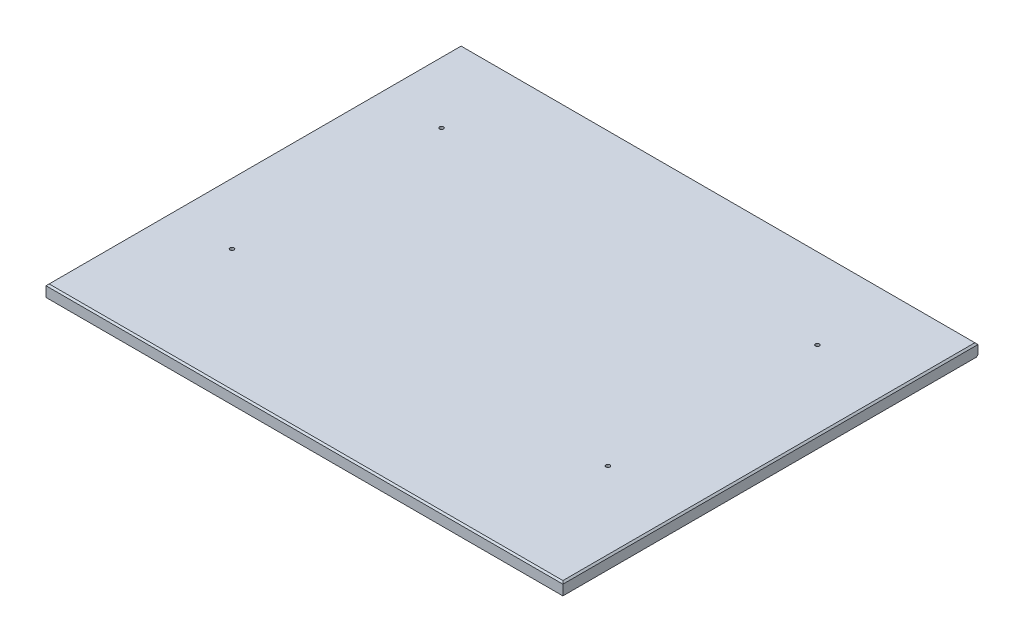
ISO-10303-21;
HEADER;
FILE_DESCRIPTION(('STEP AP214'),'2;1');
FILE_NAME('part.step','',(''),(''),'','','');
FILE_SCHEMA(('AUTOMOTIVE_DESIGN { 1 0 10303 214 1 1 1 1 }'));
ENDSEC;
DATA;
#1=APPLICATION_CONTEXT('core data for automotive mechanical design processes');
#2=APPLICATION_PROTOCOL_DEFINITION('international standard','automotive_design',2000,#1);
#3=PRODUCT_CONTEXT('',#1,'mechanical');
#4=PRODUCT('Part','Part','',(#3));
#5=PRODUCT_RELATED_PRODUCT_CATEGORY('part','',(#4));
#6=PRODUCT_DEFINITION_FORMATION('','',#4);
#7=PRODUCT_DEFINITION_CONTEXT('part definition',#1,'design');
#8=PRODUCT_DEFINITION('design','',#6,#7);
#9=PRODUCT_DEFINITION_SHAPE('','',#8);
#10=(LENGTH_UNIT() NAMED_UNIT(*) SI_UNIT(.MILLI.,.METRE.));
#11=(NAMED_UNIT(*) PLANE_ANGLE_UNIT() SI_UNIT($,.RADIAN.));
#12=(NAMED_UNIT(*) SI_UNIT($,.STERADIAN.) SOLID_ANGLE_UNIT());
#13=UNCERTAINTY_MEASURE_WITH_UNIT(LENGTH_MEASURE(1.E-05),#10,'distance_accuracy_value','');
#14=(GEOMETRIC_REPRESENTATION_CONTEXT(3) GLOBAL_UNCERTAINTY_ASSIGNED_CONTEXT((#13)) GLOBAL_UNIT_ASSIGNED_CONTEXT((#10,
#11,#12)) REPRESENTATION_CONTEXT('',''));
#15=CARTESIAN_POINT('',(0.,0.,0.));
#16=DIRECTION('',(0.,0.,1.));
#17=DIRECTION('',(1.,0.,0.));
#18=AXIS2_PLACEMENT_3D('',#15,#16,#17);
#19=CARTESIAN_POINT('',(0.,19.05,0.));
#20=DIRECTION('',(1.,0.,0.));
#21=DIRECTION('',(0.,0.,-1.));
#22=AXIS2_PLACEMENT_3D('',#19,#20,#21);
#23=PLANE('',#22);
#24=DIRECTION('',(0.,-1.,0.));
#25=VECTOR('',#24,1.);
#26=CARTESIAN_POINT('',(0.,19.05,-673.1));
#27=LINE('',#26,#25);
#28=CARTESIAN_POINT('',(0.,16.51,-673.1));
#29=VERTEX_POINT('',#28);
#30=CARTESIAN_POINT('',(0.,2.53999999999999,-673.1));
#31=VERTEX_POINT('',#30);
#32=EDGE_CURVE('E118',#29,#31,#27,.T.);
#33=ORIENTED_EDGE('',*,*,#32,.T.);
#34=DIRECTION('',(0.,-0.707106781186548,0.707106781186548));
#35=VECTOR('',#34,1.);
#36=CARTESIAN_POINT('',(0.,2.53999999999999,-673.1));
#37=LINE('',#36,#35);
#38=CARTESIAN_POINT('',(0.,0.,-670.56));
#39=VERTEX_POINT('',#38);
#40=EDGE_CURVE('E64',#31,#39,#37,.T.);
#41=ORIENTED_EDGE('',*,*,#40,.T.);
#42=DIRECTION('',(0.,0.,1.));
#43=VECTOR('',#42,1.);
#44=CARTESIAN_POINT('',(0.,0.,0.));
#45=LINE('',#44,#43);
#46=CARTESIAN_POINT('',(0.,0.,0.));
#47=VERTEX_POINT('',#46);
#48=EDGE_CURVE('E98',#39,#47,#45,.T.);
#49=ORIENTED_EDGE('',*,*,#48,.T.);
#50=DIRECTION('',(0.,-1.,0.));
#51=VECTOR('',#50,1.);
#52=CARTESIAN_POINT('',(0.,19.05,0.));
#53=LINE('',#52,#51);
#54=CARTESIAN_POINT('',(0.,16.51,0.));
#55=VERTEX_POINT('',#54);
#56=EDGE_CURVE('E100',#55,#47,#53,.T.);
#57=ORIENTED_EDGE('',*,*,#56,.F.);
#58=DIRECTION('',(0.,0.,-1.));
#59=VECTOR('',#58,1.);
#60=CARTESIAN_POINT('',(0.,16.51,0.));
#61=LINE('',#60,#59);
#62=EDGE_CURVE('E141',#55,#29,#61,.T.);
#63=ORIENTED_EDGE('',*,*,#62,.T.);
#64=EDGE_LOOP('',(#33,#41,#49,#57,#63));
#65=FACE_BOUND('',#64,.T.);
#66=ADVANCED_FACE('F41',(#65),#23,.F.);
#67=CARTESIAN_POINT('',(0.,19.05,0.));
#68=DIRECTION('',(0.,0.,-1.));
#69=DIRECTION('',(-1.,0.,0.));
#70=AXIS2_PLACEMENT_3D('',#67,#68,#69);
#71=PLANE('',#70);
#72=DIRECTION('',(0.,-1.,0.));
#73=VECTOR('',#72,1.);
#74=CARTESIAN_POINT('',(838.2,19.05,0.));
#75=LINE('',#74,#73);
#76=CARTESIAN_POINT('',(838.2,16.51,0.));
#77=VERTEX_POINT('',#76);
#78=CARTESIAN_POINT('',(838.2,0.,0.));
#79=VERTEX_POINT('',#78);
#80=EDGE_CURVE('E113',#77,#79,#75,.T.);
#81=ORIENTED_EDGE('',*,*,#80,.F.);
#82=DIRECTION('',(-1.,0.,0.));
#83=VECTOR('',#82,1.);
#84=CARTESIAN_POINT('',(0.,16.51,0.));
#85=LINE('',#84,#83);
#86=EDGE_CURVE('E111',#77,#55,#85,.T.);
#87=ORIENTED_EDGE('',*,*,#86,.T.);
#88=ORIENTED_EDGE('',*,*,#56,.T.);
#89=DIRECTION('',(1.,0.,0.));
#90=VECTOR('',#89,1.);
#91=CARTESIAN_POINT('',(0.,0.,0.));
#92=LINE('',#91,#90);
#93=EDGE_CURVE('E103',#47,#79,#92,.T.);
#94=ORIENTED_EDGE('',*,*,#93,.T.);
#95=EDGE_LOOP('',(#81,#87,#88,#94));
#96=FACE_BOUND('',#95,.T.);
#97=ADVANCED_FACE('F109',(#96),#71,.F.);
#98=CARTESIAN_POINT('',(838.2,19.05,0.));
#99=DIRECTION('',(-1.,0.,0.));
#100=DIRECTION('',(0.,0.,1.));
#101=AXIS2_PLACEMENT_3D('',#98,#99,#100);
#102=PLANE('',#101);
#103=DIRECTION('',(0.,0.,-1.));
#104=VECTOR('',#103,1.);
#105=CARTESIAN_POINT('',(838.2,0.,0.));
#106=LINE('',#105,#104);
#107=CARTESIAN_POINT('',(838.2,0.,-670.56));
#108=VERTEX_POINT('',#107);
#109=EDGE_CURVE('E116',#79,#108,#106,.T.);
#110=ORIENTED_EDGE('',*,*,#109,.T.);
#111=DIRECTION('',(0.,0.707106781186548,-0.707106781186548));
#112=VECTOR('',#111,1.);
#113=CARTESIAN_POINT('',(838.2,2.53999999999999,-673.1));
#114=LINE('',#113,#112);
#115=CARTESIAN_POINT('',(838.2,2.53999999999999,-673.1));
#116=VERTEX_POINT('',#115);
#117=EDGE_CURVE('E11',#108,#116,#114,.T.);
#118=ORIENTED_EDGE('',*,*,#117,.T.);
#119=DIRECTION('',(0.,-1.,0.));
#120=VECTOR('',#119,1.);
#121=CARTESIAN_POINT('',(838.2,19.05,-673.1));
#122=LINE('',#121,#120);
#123=CARTESIAN_POINT('',(838.2,16.51,-673.1));
#124=VERTEX_POINT('',#123);
#125=EDGE_CURVE('E123',#124,#116,#122,.T.);
#126=ORIENTED_EDGE('',*,*,#125,.F.);
#127=DIRECTION('',(0.,0.,1.));
#128=VECTOR('',#127,1.);
#129=CARTESIAN_POINT('',(838.2,16.51,0.));
#130=LINE('',#129,#128);
#131=EDGE_CURVE('E138',#124,#77,#130,.T.);
#132=ORIENTED_EDGE('',*,*,#131,.T.);
#133=ORIENTED_EDGE('',*,*,#80,.T.);
#134=EDGE_LOOP('',(#110,#118,#126,#132,#133));
#135=FACE_BOUND('',#134,.T.);
#136=ADVANCED_FACE('F175',(#135),#102,.F.);
#137=CARTESIAN_POINT('',(0.,19.05,-673.1));
#138=DIRECTION('',(0.,0.,1.));
#139=DIRECTION('',(1.,0.,0.));
#140=AXIS2_PLACEMENT_3D('',#137,#138,#139);
#141=PLANE('',#140);
#142=ORIENTED_EDGE('',*,*,#125,.T.);
#143=DIRECTION('',(-1.,0.,0.));
#144=VECTOR('',#143,1.);
#145=CARTESIAN_POINT('',(0.,2.53999999999999,-673.1));
#146=LINE('',#145,#144);
#147=EDGE_CURVE('E143',#116,#31,#146,.T.);
#148=ORIENTED_EDGE('',*,*,#147,.T.);
#149=ORIENTED_EDGE('',*,*,#32,.F.);
#150=DIRECTION('',(1.,0.,0.));
#151=VECTOR('',#150,1.);
#152=CARTESIAN_POINT('',(0.,16.51,-673.1));
#153=LINE('',#152,#151);
#154=EDGE_CURVE('E135',#29,#124,#153,.T.);
#155=ORIENTED_EDGE('',*,*,#154,.T.);
#156=EDGE_LOOP('',(#142,#148,#149,#155));
#157=FACE_BOUND('',#156,.T.);
#158=ADVANCED_FACE('F159',(#157),#141,.F.);
#159=CARTESIAN_POINT('',(0.,19.05,0.));
#160=DIRECTION('',(0.,-1.,0.));
#161=DIRECTION('',(0.,0.,-1.));
#162=AXIS2_PLACEMENT_3D('',#159,#160,#161);
#163=PLANE('',#162);
#164=CARTESIAN_POINT('',(101.6,19.05,-200.025));
#165=DIRECTION('',(0.,1.,0.));
#166=DIRECTION('',(0.,0.,1.));
#167=AXIS2_PLACEMENT_3D('',#164,#165,#166);
#168=CIRCLE('',#167,3.175);
#169=CARTESIAN_POINT('',(101.6,19.05,-196.85));
#170=VERTEX_POINT('',#169);
#171=EDGE_CURVE('E322',#170,#170,#168,.T.);
#172=ORIENTED_EDGE('',*,*,#171,.F.);
#173=EDGE_LOOP('',(#172));
#174=FACE_BOUND('',#173,.T.);
#175=CARTESIAN_POINT('',(711.2,19.05,-539.75));
#176=DIRECTION('',(0.,1.,0.));
#177=DIRECTION('',(0.,0.,1.));
#178=AXIS2_PLACEMENT_3D('',#175,#176,#177);
#179=CIRCLE('',#178,3.17500000000008);
#180=CARTESIAN_POINT('',(711.2,19.05,-536.575));
#181=VERTEX_POINT('',#180);
#182=EDGE_CURVE('E326',#181,#181,#179,.T.);
#183=ORIENTED_EDGE('',*,*,#182,.F.);
#184=EDGE_LOOP('',(#183));
#185=FACE_BOUND('',#184,.T.);
#186=CARTESIAN_POINT('',(711.2,19.05,-200.025));
#187=DIRECTION('',(0.,1.,0.));
#188=DIRECTION('',(0.,0.,1.));
#189=AXIS2_PLACEMENT_3D('',#186,#187,#188);
#190=CIRCLE('',#189,3.17500000000009);
#191=CARTESIAN_POINT('',(711.2,19.05,-196.85));
#192=VERTEX_POINT('',#191);
#193=EDGE_CURVE('E337',#192,#192,#190,.T.);
#194=ORIENTED_EDGE('',*,*,#193,.F.);
#195=EDGE_LOOP('',(#194));
#196=FACE_BOUND('',#195,.T.);
#197=CARTESIAN_POINT('',(101.6,19.05,-539.75));
#198=DIRECTION('',(0.,1.,0.));
#199=DIRECTION('',(0.,0.,1.));
#200=AXIS2_PLACEMENT_3D('',#197,#198,#199);
#201=CIRCLE('',#200,3.175);
#202=CARTESIAN_POINT('',(101.6,19.05,-536.575));
#203=VERTEX_POINT('',#202);
#204=EDGE_CURVE('E323',#203,#203,#201,.T.);
#205=ORIENTED_EDGE('',*,*,#204,.F.);
#206=EDGE_LOOP('',(#205));
#207=FACE_BOUND('',#206,.T.);
#208=DIRECTION('',(0.,0.,-1.));
#209=VECTOR('',#208,1.);
#210=CARTESIAN_POINT('',(835.66,19.05,0.));
#211=LINE('',#210,#209);
#212=CARTESIAN_POINT('',(835.66,19.05,-2.53999999999999));
#213=VERTEX_POINT('',#212);
#214=CARTESIAN_POINT('',(835.66,19.05,-670.56));
#215=VERTEX_POINT('',#214);
#216=EDGE_CURVE('E130',#213,#215,#211,.T.);
#217=ORIENTED_EDGE('',*,*,#216,.T.);
#218=DIRECTION('',(-1.,0.,0.));
#219=VECTOR('',#218,1.);
#220=CARTESIAN_POINT('',(0.,19.05,-670.56));
#221=LINE('',#220,#219);
#222=CARTESIAN_POINT('',(2.53999999999999,19.05,-670.56));
#223=VERTEX_POINT('',#222);
#224=EDGE_CURVE('E132',#215,#223,#221,.T.);
#225=ORIENTED_EDGE('',*,*,#224,.T.);
#226=DIRECTION('',(0.,0.,1.));
#227=VECTOR('',#226,1.);
#228=CARTESIAN_POINT('',(2.53999999999999,19.05,0.));
#229=LINE('',#228,#227);
#230=CARTESIAN_POINT('',(2.53999999999999,19.05,-2.53999999999999));
#231=VERTEX_POINT('',#230);
#232=EDGE_CURVE('E112',#223,#231,#229,.T.);
#233=ORIENTED_EDGE('',*,*,#232,.T.);
#234=DIRECTION('',(1.,0.,0.));
#235=VECTOR('',#234,1.);
#236=CARTESIAN_POINT('',(0.,19.05,-2.53999999999999));
#237=LINE('',#236,#235);
#238=EDGE_CURVE('E128',#231,#213,#237,.T.);
#239=ORIENTED_EDGE('',*,*,#238,.T.);
#240=EDGE_LOOP('',(#217,#225,#233,#239));
#241=FACE_BOUND('',#240,.T.);
#242=ADVANCED_FACE('F220',(#174,#185,#196,#207,#241),#163,.F.);
#243=CARTESIAN_POINT('',(0.,0.,0.));
#244=DIRECTION('',(0.,-1.,0.));
#245=DIRECTION('',(0.,0.,-1.));
#246=AXIS2_PLACEMENT_3D('',#243,#244,#245);
#247=PLANE('',#246);
#248=CARTESIAN_POINT('',(101.6,0.,-200.025));
#249=DIRECTION('',(0.,1.,0.));
#250=DIRECTION('',(0.,0.,1.));
#251=AXIS2_PLACEMENT_3D('',#248,#249,#250);
#252=CIRCLE('',#251,3.175);
#253=CARTESIAN_POINT('',(101.6,0.,-196.85));
#254=VERTEX_POINT('',#253);
#255=EDGE_CURVE('E320',#254,#254,#252,.T.);
#256=ORIENTED_EDGE('',*,*,#255,.T.);
#257=EDGE_LOOP('',(#256));
#258=FACE_BOUND('',#257,.T.);
#259=CARTESIAN_POINT('',(711.2,0.,-539.75));
#260=DIRECTION('',(0.,1.,0.));
#261=DIRECTION('',(0.,0.,1.));
#262=AXIS2_PLACEMENT_3D('',#259,#260,#261);
#263=CIRCLE('',#262,3.17500000000008);
#264=CARTESIAN_POINT('',(711.2,0.,-536.575));
#265=VERTEX_POINT('',#264);
#266=EDGE_CURVE('E334',#265,#265,#263,.T.);
#267=ORIENTED_EDGE('',*,*,#266,.T.);
#268=EDGE_LOOP('',(#267));
#269=FACE_BOUND('',#268,.T.);
#270=CARTESIAN_POINT('',(711.2,0.,-200.025));
#271=DIRECTION('',(0.,1.,0.));
#272=DIRECTION('',(0.,0.,1.));
#273=AXIS2_PLACEMENT_3D('',#270,#271,#272);
#274=CIRCLE('',#273,3.17500000000009);
#275=CARTESIAN_POINT('',(711.2,0.,-196.85));
#276=VERTEX_POINT('',#275);
#277=EDGE_CURVE('E329',#276,#276,#274,.T.);
#278=ORIENTED_EDGE('',*,*,#277,.T.);
#279=EDGE_LOOP('',(#278));
#280=FACE_BOUND('',#279,.T.);
#281=CARTESIAN_POINT('',(101.6,0.,-539.75));
#282=DIRECTION('',(0.,1.,0.));
#283=DIRECTION('',(0.,0.,1.));
#284=AXIS2_PLACEMENT_3D('',#281,#282,#283);
#285=CIRCLE('',#284,3.175);
#286=CARTESIAN_POINT('',(101.6,0.,-536.575));
#287=VERTEX_POINT('',#286);
#288=EDGE_CURVE('E147',#287,#287,#285,.T.);
#289=ORIENTED_EDGE('',*,*,#288,.T.);
#290=EDGE_LOOP('',(#289));
#291=FACE_BOUND('',#290,.T.);
#292=ORIENTED_EDGE('',*,*,#48,.F.);
#293=DIRECTION('',(1.,0.,0.));
#294=VECTOR('',#293,1.);
#295=CARTESIAN_POINT('',(838.2,0.,-670.56));
#296=LINE('',#295,#294);
#297=EDGE_CURVE('E50',#39,#108,#296,.T.);
#298=ORIENTED_EDGE('',*,*,#297,.T.);
#299=ORIENTED_EDGE('',*,*,#109,.F.);
#300=ORIENTED_EDGE('',*,*,#93,.F.);
#301=EDGE_LOOP('',(#292,#298,#299,#300));
#302=FACE_BOUND('',#301,.T.);
#303=ADVANCED_FACE('F115',(#258,#269,#280,#291,#302),#247,.T.);
#304=CARTESIAN_POINT('',(0.,19.05,-2.53999999999999));
#305=DIRECTION('',(0.,-0.707106781186547,-0.707106781186548));
#306=DIRECTION('',(1.,0.,0.));
#307=AXIS2_PLACEMENT_3D('',#304,#305,#306);
#308=PLANE('',#307);
#309=DIRECTION('',(0.577350269189626,0.577350269189626,-0.577350269189626));
#310=VECTOR('',#309,1.);
#311=CARTESIAN_POINT('',(1.69333333333332,18.2033333333333,-1.69333333333332));
#312=LINE('',#311,#310);
#313=EDGE_CURVE('E149',#55,#231,#312,.T.);
#314=ORIENTED_EDGE('',*,*,#313,.F.);
#315=ORIENTED_EDGE('',*,*,#86,.F.);
#316=DIRECTION('',(-0.577350269189626,0.577350269189626,-0.577350269189626));
#317=VECTOR('',#316,1.);
#318=CARTESIAN_POINT('',(557.106666666667,297.603333333333,-281.093333333333));
#319=LINE('',#318,#317);
#320=EDGE_CURVE('E104',#213,#77,#319,.F.);
#321=ORIENTED_EDGE('',*,*,#320,.F.);
#322=ORIENTED_EDGE('',*,*,#238,.F.);
#323=EDGE_LOOP('',(#314,#315,#321,#322));
#324=FACE_BOUND('',#323,.T.);
#325=ADVANCED_FACE('F211',(#324),#308,.F.);
#326=CARTESIAN_POINT('',(835.66,19.05,0.));
#327=DIRECTION('',(-0.707106781186548,-0.707106781186548,0.));
#328=DIRECTION('',(0.,0.,-1.));
#329=AXIS2_PLACEMENT_3D('',#326,#327,#328);
#330=PLANE('',#329);
#331=ORIENTED_EDGE('',*,*,#320,.T.);
#332=ORIENTED_EDGE('',*,*,#131,.F.);
#333=DIRECTION('',(-0.577350269189626,0.577350269189626,0.577350269189626));
#334=VECTOR('',#333,1.);
#335=CARTESIAN_POINT('',(612.14,242.57,-447.04));
#336=LINE('',#335,#334);
#337=EDGE_CURVE('E146',#215,#124,#336,.F.);
#338=ORIENTED_EDGE('',*,*,#337,.F.);
#339=ORIENTED_EDGE('',*,*,#216,.F.);
#340=EDGE_LOOP('',(#331,#332,#338,#339));
#341=FACE_BOUND('',#340,.T.);
#342=ADVANCED_FACE('F206',(#341),#330,.F.);
#343=CARTESIAN_POINT('',(2.53999999999999,19.05,0.));
#344=DIRECTION('',(0.707106781186548,-0.707106781186547,0.));
#345=DIRECTION('',(0.,0.,1.));
#346=AXIS2_PLACEMENT_3D('',#343,#344,#345);
#347=PLANE('',#346);
#348=ORIENTED_EDGE('',*,*,#313,.T.);
#349=ORIENTED_EDGE('',*,*,#232,.F.);
#350=DIRECTION('',(-0.577350269189626,-0.577350269189626,-0.577350269189626));
#351=VECTOR('',#350,1.);
#352=CARTESIAN_POINT('',(226.06,242.57,-447.04));
#353=LINE('',#352,#351);
#354=EDGE_CURVE('E144',#29,#223,#353,.F.);
#355=ORIENTED_EDGE('',*,*,#354,.F.);
#356=ORIENTED_EDGE('',*,*,#62,.F.);
#357=EDGE_LOOP('',(#348,#349,#355,#356));
#358=FACE_BOUND('',#357,.T.);
#359=ADVANCED_FACE('F167',(#358),#347,.F.);
#360=CARTESIAN_POINT('',(0.,19.05,-670.56));
#361=DIRECTION('',(0.,-0.707106781186548,0.707106781186548));
#362=DIRECTION('',(-1.,0.,0.));
#363=AXIS2_PLACEMENT_3D('',#360,#361,#362);
#364=PLANE('',#363);
#365=ORIENTED_EDGE('',*,*,#337,.T.);
#366=ORIENTED_EDGE('',*,*,#154,.F.);
#367=ORIENTED_EDGE('',*,*,#354,.T.);
#368=ORIENTED_EDGE('',*,*,#224,.F.);
#369=EDGE_LOOP('',(#365,#366,#367,#368));
#370=FACE_BOUND('',#369,.T.);
#371=ADVANCED_FACE('F171',(#370),#364,.F.);
#372=CARTESIAN_POINT('',(0.,2.53999999999999,-673.1));
#373=DIRECTION('',(0.,-0.707106781186548,-0.707106781186548));
#374=DIRECTION('',(1.,0.,0.));
#375=AXIS2_PLACEMENT_3D('',#372,#373,#374);
#376=PLANE('',#375);
#377=ORIENTED_EDGE('',*,*,#117,.F.);
#378=ORIENTED_EDGE('',*,*,#297,.F.);
#379=ORIENTED_EDGE('',*,*,#40,.F.);
#380=ORIENTED_EDGE('',*,*,#147,.F.);
#381=EDGE_LOOP('',(#377,#378,#379,#380));
#382=FACE_BOUND('',#381,.T.);
#383=ADVANCED_FACE('F44',(#382),#376,.T.);
#384=CARTESIAN_POINT('',(101.6,0.,-539.75));
#385=DIRECTION('',(0.,1.,0.));
#386=DIRECTION('',(0.,0.,1.));
#387=AXIS2_PLACEMENT_3D('',#384,#385,#386);
#388=CYLINDRICAL_SURFACE('',#387,3.175);
#389=ORIENTED_EDGE('',*,*,#288,.F.);
#390=EDGE_LOOP('',(#389));
#391=FACE_BOUND('',#390,.T.);
#392=ORIENTED_EDGE('',*,*,#204,.T.);
#393=EDGE_LOOP('',(#392));
#394=FACE_BOUND('',#393,.T.);
#395=ADVANCED_FACE('F177',(#391,#394),#388,.F.);
#396=CARTESIAN_POINT('',(711.2,0.,-200.025));
#397=DIRECTION('',(0.,1.,0.));
#398=DIRECTION('',(0.,0.,1.));
#399=AXIS2_PLACEMENT_3D('',#396,#397,#398);
#400=CYLINDRICAL_SURFACE('',#399,3.17500000000009);
#401=ORIENTED_EDGE('',*,*,#277,.F.);
#402=EDGE_LOOP('',(#401));
#403=FACE_BOUND('',#402,.T.);
#404=ORIENTED_EDGE('',*,*,#193,.T.);
#405=EDGE_LOOP('',(#404));
#406=FACE_BOUND('',#405,.T.);
#407=ADVANCED_FACE('F183',(#403,#406),#400,.F.);
#408=CARTESIAN_POINT('',(711.2,0.,-539.75));
#409=DIRECTION('',(0.,1.,0.));
#410=DIRECTION('',(0.,0.,1.));
#411=AXIS2_PLACEMENT_3D('',#408,#409,#410);
#412=CYLINDRICAL_SURFACE('',#411,3.17500000000008);
#413=ORIENTED_EDGE('',*,*,#266,.F.);
#414=EDGE_LOOP('',(#413));
#415=FACE_BOUND('',#414,.T.);
#416=ORIENTED_EDGE('',*,*,#182,.T.);
#417=EDGE_LOOP('',(#416));
#418=FACE_BOUND('',#417,.T.);
#419=ADVANCED_FACE('F295',(#415,#418),#412,.F.);
#420=CARTESIAN_POINT('',(101.6,0.,-200.025));
#421=DIRECTION('',(0.,1.,0.));
#422=DIRECTION('',(0.,0.,1.));
#423=AXIS2_PLACEMENT_3D('',#420,#421,#422);
#424=CYLINDRICAL_SURFACE('',#423,3.175);
#425=ORIENTED_EDGE('',*,*,#255,.F.);
#426=EDGE_LOOP('',(#425));
#427=FACE_BOUND('',#426,.T.);
#428=ORIENTED_EDGE('',*,*,#171,.T.);
#429=EDGE_LOOP('',(#428));
#430=FACE_BOUND('',#429,.T.);
#431=ADVANCED_FACE('F305',(#427,#430),#424,.F.);
#432=CLOSED_SHELL('',(#66,#97,#136,#158,#242,#303,#325,#342,#359,#371,#383,#395,#407,#419,#431));
#433=MANIFOLD_SOLID_BREP('B2',#432);
#434=ADVANCED_BREP_SHAPE_REPRESENTATION('',(#18,#433),#14);
#435=SHAPE_DEFINITION_REPRESENTATION(#9,#434);
ENDSEC;
END-ISO-10303-21;
